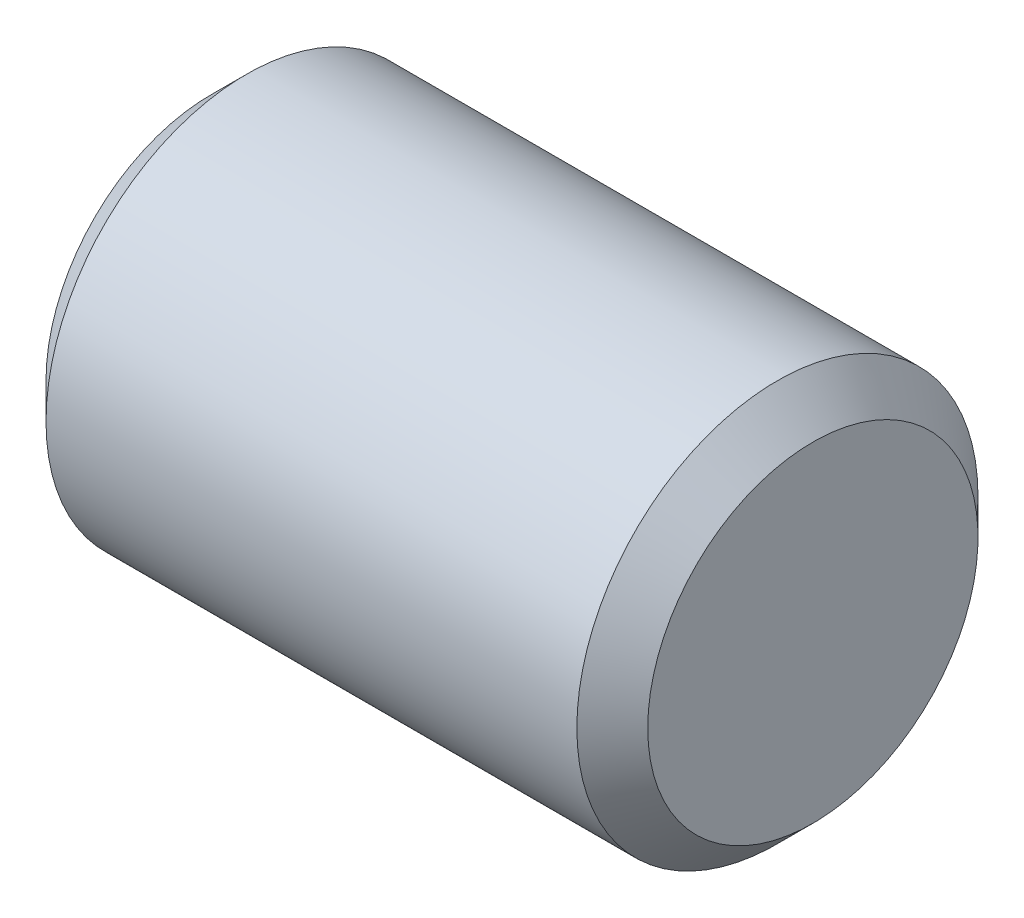
ISO-10303-21;
HEADER;
FILE_DESCRIPTION(('STEP AP214'),'2;1');
FILE_NAME('part.step','',(''),(''),'','','');
FILE_SCHEMA(('AUTOMOTIVE_DESIGN { 1 0 10303 214 1 1 1 1 }'));
ENDSEC;
DATA;
#1=APPLICATION_CONTEXT('core data for automotive mechanical design processes');
#2=APPLICATION_PROTOCOL_DEFINITION('international standard','automotive_design',2000,#1);
#3=PRODUCT_CONTEXT('',#1,'mechanical');
#4=PRODUCT('Part','Part','',(#3));
#5=PRODUCT_RELATED_PRODUCT_CATEGORY('part','',(#4));
#6=PRODUCT_DEFINITION_FORMATION('','',#4);
#7=PRODUCT_DEFINITION_CONTEXT('part definition',#1,'design');
#8=PRODUCT_DEFINITION('design','',#6,#7);
#9=PRODUCT_DEFINITION_SHAPE('','',#8);
#10=(LENGTH_UNIT() NAMED_UNIT(*) SI_UNIT(.MILLI.,.METRE.));
#11=(NAMED_UNIT(*) PLANE_ANGLE_UNIT() SI_UNIT($,.RADIAN.));
#12=(NAMED_UNIT(*) SI_UNIT($,.STERADIAN.) SOLID_ANGLE_UNIT());
#13=UNCERTAINTY_MEASURE_WITH_UNIT(LENGTH_MEASURE(1.E-05),#10,'distance_accuracy_value','');
#14=(GEOMETRIC_REPRESENTATION_CONTEXT(3) GLOBAL_UNCERTAINTY_ASSIGNED_CONTEXT((#13)) GLOBAL_UNIT_ASSIGNED_CONTEXT((#10,
#11,#12)) REPRESENTATION_CONTEXT('',''));
#15=CARTESIAN_POINT('',(0.,0.,0.));
#16=DIRECTION('',(0.,0.,1.));
#17=DIRECTION('',(1.,0.,0.));
#18=AXIS2_PLACEMENT_3D('',#15,#16,#17);
#19=CARTESIAN_POINT('',(-2.86363636363636,0.,0.));
#20=DIRECTION('',(-1.,0.,0.));
#21=DIRECTION('',(0.,0.,1.));
#22=AXIS2_PLACEMENT_3D('',#19,#20,#21);
#23=PLANE('',#22);
#24=CARTESIAN_POINT('',(-2.86363636363636,0.,0.));
#25=DIRECTION('',(-1.,0.,0.));
#26=DIRECTION('',(0.,0.,1.));
#27=AXIS2_PLACEMENT_3D('',#24,#25,#26);
#28=CIRCLE('',#27,1.64644660940673);
#29=CARTESIAN_POINT('',(-2.86363636363636,0.,1.64644660940673));
#30=VERTEX_POINT('',#29);
#31=EDGE_CURVE('E10',#30,#30,#28,.T.);
#32=ORIENTED_EDGE('',*,*,#31,.T.);
#33=EDGE_LOOP('',(#32));
#34=FACE_BOUND('',#33,.T.);
#35=ADVANCED_FACE('F35',(#34),#23,.T.);
#36=CARTESIAN_POINT('',(-2.86363636363636,0.,0.));
#37=DIRECTION('',(1.,0.,0.));
#38=DIRECTION('',(0.,0.,-1.));
#39=AXIS2_PLACEMENT_3D('',#36,#37,#38);
#40=CONICAL_SURFACE('',#39,1.64644660940673,0.785398163397449);
#41=CARTESIAN_POINT('',(-2.51008297304309,0.,0.));
#42=DIRECTION('',(-1.,0.,0.));
#43=DIRECTION('',(0.,0.,1.));
#44=AXIS2_PLACEMENT_3D('',#41,#42,#43);
#45=CIRCLE('',#44,2.);
#46=CARTESIAN_POINT('',(-2.51008297304309,0.,2.));
#47=VERTEX_POINT('',#46);
#48=EDGE_CURVE('E41',#47,#47,#45,.T.);
#49=ORIENTED_EDGE('',*,*,#48,.T.);
#50=EDGE_LOOP('',(#49));
#51=FACE_BOUND('',#50,.T.);
#52=ORIENTED_EDGE('',*,*,#31,.F.);
#53=EDGE_LOOP('',(#52));
#54=FACE_BOUND('',#53,.T.);
#55=ADVANCED_FACE('F67',(#51,#54),#40,.T.);
#56=CARTESIAN_POINT('',(-4.96524064171123,0.,0.));
#57=DIRECTION('',(-1.,0.,0.));
#58=DIRECTION('',(0.,0.,1.));
#59=AXIS2_PLACEMENT_3D('',#56,#57,#58);
#60=CYLINDRICAL_SURFACE('',#59,2.);
#61=CARTESIAN_POINT('',(2.78281024577036,0.,0.));
#62=DIRECTION('',(-1.,0.,0.));
#63=DIRECTION('',(0.,0.,1.));
#64=AXIS2_PLACEMENT_3D('',#61,#62,#63);
#65=CIRCLE('',#64,2.);
#66=CARTESIAN_POINT('',(2.78281024577036,0.,2.));
#67=VERTEX_POINT('',#66);
#68=EDGE_CURVE('E45',#67,#67,#65,.T.);
#69=ORIENTED_EDGE('',*,*,#68,.T.);
#70=EDGE_LOOP('',(#69));
#71=FACE_BOUND('',#70,.T.);
#72=ORIENTED_EDGE('',*,*,#48,.F.);
#73=EDGE_LOOP('',(#72));
#74=FACE_BOUND('',#73,.T.);
#75=ADVANCED_FACE('F64',(#71,#74),#60,.T.);
#76=CARTESIAN_POINT('',(2.78281024577036,0.,0.));
#77=DIRECTION('',(-1.,0.,0.));
#78=DIRECTION('',(0.,0.,1.));
#79=AXIS2_PLACEMENT_3D('',#76,#77,#78);
#80=CONICAL_SURFACE('',#79,2.,0.785398163397448);
#81=CARTESIAN_POINT('',(3.13636363636364,0.,0.));
#82=DIRECTION('',(-1.,0.,0.));
#83=DIRECTION('',(0.,0.,1.));
#84=AXIS2_PLACEMENT_3D('',#81,#82,#83);
#85=CIRCLE('',#84,1.64644660940673);
#86=CARTESIAN_POINT('',(3.13636363636364,0.,1.64644660940673));
#87=VERTEX_POINT('',#86);
#88=EDGE_CURVE('E49',#87,#87,#85,.T.);
#89=ORIENTED_EDGE('',*,*,#88,.T.);
#90=EDGE_LOOP('',(#89));
#91=FACE_BOUND('',#90,.T.);
#92=ORIENTED_EDGE('',*,*,#68,.F.);
#93=EDGE_LOOP('',(#92));
#94=FACE_BOUND('',#93,.T.);
#95=ADVANCED_FACE('F55',(#91,#94),#80,.T.);
#96=CARTESIAN_POINT('',(3.13636363636364,-1.64644660940673,0.));
#97=DIRECTION('',(1.,0.,0.));
#98=DIRECTION('',(0.,0.,-1.));
#99=AXIS2_PLACEMENT_3D('',#96,#97,#98);
#100=PLANE('',#99);
#101=ORIENTED_EDGE('',*,*,#88,.F.);
#102=EDGE_LOOP('',(#101));
#103=FACE_BOUND('',#102,.T.);
#104=ADVANCED_FACE('F58',(#103),#100,.T.);
#105=CLOSED_SHELL('',(#35,#55,#75,#95,#104));
#106=MANIFOLD_SOLID_BREP('B2',#105);
#107=ADVANCED_BREP_SHAPE_REPRESENTATION('',(#18,#106),#14);
#108=SHAPE_DEFINITION_REPRESENTATION(#9,#107);
ENDSEC;
END-ISO-10303-21;
